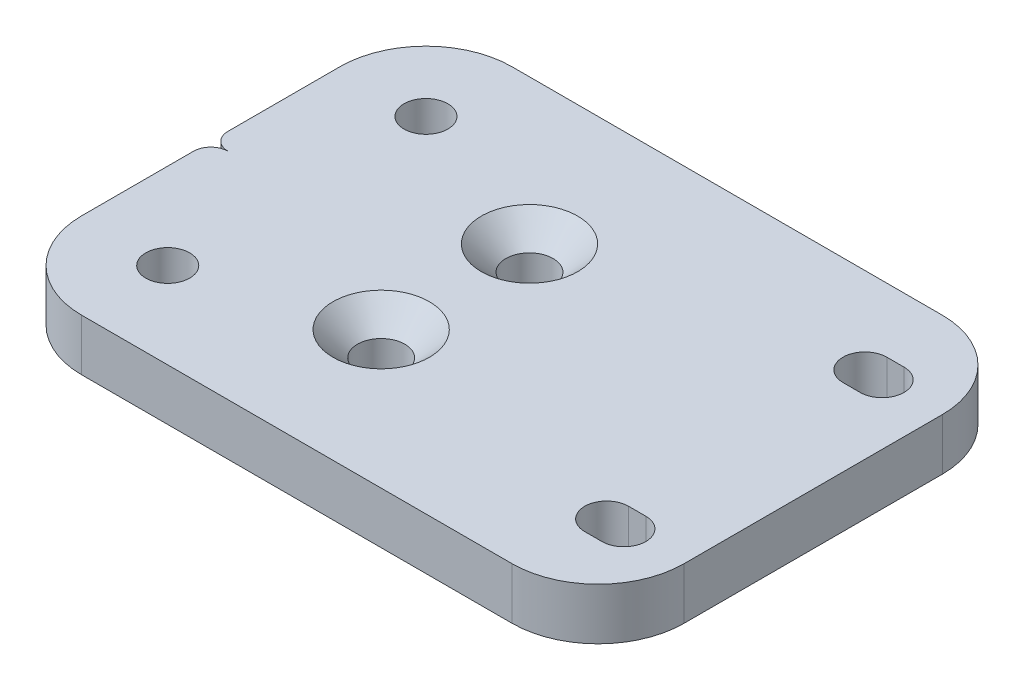
ISO-10303-21;
HEADER;
FILE_DESCRIPTION(('STEP AP214'),'2;1');
FILE_NAME('part.step','',(''),(''),'','','');
FILE_SCHEMA(('AUTOMOTIVE_DESIGN { 1 0 10303 214 1 1 1 1 }'));
ENDSEC;
DATA;
#1=APPLICATION_CONTEXT('core data for automotive mechanical design processes');
#2=APPLICATION_PROTOCOL_DEFINITION('international standard','automotive_design',2000,#1);
#3=PRODUCT_CONTEXT('',#1,'mechanical');
#4=PRODUCT('Part','Part','',(#3));
#5=PRODUCT_RELATED_PRODUCT_CATEGORY('part','',(#4));
#6=PRODUCT_DEFINITION_FORMATION('','',#4);
#7=PRODUCT_DEFINITION_CONTEXT('part definition',#1,'design');
#8=PRODUCT_DEFINITION('design','',#6,#7);
#9=PRODUCT_DEFINITION_SHAPE('','',#8);
#10=(LENGTH_UNIT() NAMED_UNIT(*) SI_UNIT(.MILLI.,.METRE.));
#11=(NAMED_UNIT(*) PLANE_ANGLE_UNIT() SI_UNIT($,.RADIAN.));
#12=(NAMED_UNIT(*) SI_UNIT($,.STERADIAN.) SOLID_ANGLE_UNIT());
#13=UNCERTAINTY_MEASURE_WITH_UNIT(LENGTH_MEASURE(1.E-05),#10,'distance_accuracy_value','');
#14=(GEOMETRIC_REPRESENTATION_CONTEXT(3) GLOBAL_UNCERTAINTY_ASSIGNED_CONTEXT((#13)) GLOBAL_UNIT_ASSIGNED_CONTEXT((#10,
#11,#12)) REPRESENTATION_CONTEXT('',''));
#15=CARTESIAN_POINT('',(0.,0.,0.));
#16=DIRECTION('',(0.,0.,1.));
#17=DIRECTION('',(1.,0.,0.));
#18=AXIS2_PLACEMENT_3D('',#15,#16,#17);
#19=CARTESIAN_POINT('',(-35.,6.,15.));
#20=DIRECTION('',(1.,0.,0.));
#21=DIRECTION('',(0.,0.,-1.));
#22=AXIS2_PLACEMENT_3D('',#19,#20,#21);
#23=PLANE('',#22);
#24=DIRECTION('',(0.,-1.,0.));
#25=VECTOR('',#24,1.);
#26=CARTESIAN_POINT('',(-35.,6.,2.));
#27=LINE('',#26,#25);
#28=CARTESIAN_POINT('',(-35.,6.,2.));
#29=VERTEX_POINT('',#28);
#30=CARTESIAN_POINT('',(-35.,0.,2.));
#31=VERTEX_POINT('',#30);
#32=EDGE_CURVE('E166',#29,#31,#27,.T.);
#33=ORIENTED_EDGE('',*,*,#32,.T.);
#34=DIRECTION('',(0.,0.,1.));
#35=VECTOR('',#34,1.);
#36=CARTESIAN_POINT('',(-35.,0.,15.));
#37=LINE('',#36,#35);
#38=CARTESIAN_POINT('',(-35.,0.,15.));
#39=VERTEX_POINT('',#38);
#40=EDGE_CURVE('E212',#31,#39,#37,.T.);
#41=ORIENTED_EDGE('',*,*,#40,.T.);
#42=DIRECTION('',(0.,-1.,0.));
#43=VECTOR('',#42,1.);
#44=CARTESIAN_POINT('',(-35.,6.,15.));
#45=LINE('',#44,#43);
#46=CARTESIAN_POINT('',(-35.,6.,15.));
#47=VERTEX_POINT('',#46);
#48=EDGE_CURVE('E186',#47,#39,#45,.T.);
#49=ORIENTED_EDGE('',*,*,#48,.F.);
#50=DIRECTION('',(0.,0.,1.));
#51=VECTOR('',#50,1.);
#52=CARTESIAN_POINT('',(-35.,6.,15.));
#53=LINE('',#52,#51);
#54=EDGE_CURVE('E180',#29,#47,#53,.T.);
#55=ORIENTED_EDGE('',*,*,#54,.F.);
#56=EDGE_LOOP('',(#33,#41,#49,#55));
#57=FACE_BOUND('',#56,.T.);
#58=ADVANCED_FACE('F34',(#57),#23,.F.);
#59=CARTESIAN_POINT('',(25.,6.,-15.));
#60=DIRECTION('',(0.,-1.,0.));
#61=DIRECTION('',(0.,0.,-1.));
#62=AXIS2_PLACEMENT_3D('',#59,#60,#61);
#63=CYLINDRICAL_SURFACE('',#62,10.);
#64=CARTESIAN_POINT('',(25.,0.,-15.));
#65=DIRECTION('',(0.,1.,0.));
#66=DIRECTION('',(0.,0.,-1.));
#67=AXIS2_PLACEMENT_3D('',#64,#65,#66);
#68=CIRCLE('',#67,10.);
#69=CARTESIAN_POINT('',(35.,0.,-15.));
#70=VERTEX_POINT('',#69);
#71=CARTESIAN_POINT('',(25.,0.,-25.));
#72=VERTEX_POINT('',#71);
#73=EDGE_CURVE('E204',#70,#72,#68,.T.);
#74=ORIENTED_EDGE('',*,*,#73,.T.);
#75=DIRECTION('',(0.,-1.,0.));
#76=VECTOR('',#75,1.);
#77=CARTESIAN_POINT('',(25.,6.,-25.));
#78=LINE('',#77,#76);
#79=CARTESIAN_POINT('',(25.,6.,-25.));
#80=VERTEX_POINT('',#79);
#81=EDGE_CURVE('E11',#80,#72,#78,.T.);
#82=ORIENTED_EDGE('',*,*,#81,.F.);
#83=CARTESIAN_POINT('',(25.,6.,-15.));
#84=DIRECTION('',(0.,1.,0.));
#85=DIRECTION('',(0.,0.,-1.));
#86=AXIS2_PLACEMENT_3D('',#83,#84,#85);
#87=CIRCLE('',#86,10.);
#88=CARTESIAN_POINT('',(35.,6.,-15.));
#89=VERTEX_POINT('',#88);
#90=EDGE_CURVE('E224',#89,#80,#87,.T.);
#91=ORIENTED_EDGE('',*,*,#90,.F.);
#92=DIRECTION('',(0.,-1.,0.));
#93=VECTOR('',#92,1.);
#94=CARTESIAN_POINT('',(35.,6.,-15.));
#95=LINE('',#94,#93);
#96=EDGE_CURVE('E203',#89,#70,#95,.T.);
#97=ORIENTED_EDGE('',*,*,#96,.T.);
#98=EDGE_LOOP('',(#74,#82,#91,#97));
#99=FACE_BOUND('',#98,.T.);
#100=ADVANCED_FACE('F36',(#99),#63,.T.);
#101=CARTESIAN_POINT('',(-25.,6.,-25.));
#102=DIRECTION('',(0.,0.,1.));
#103=DIRECTION('',(1.,0.,0.));
#104=AXIS2_PLACEMENT_3D('',#101,#102,#103);
#105=PLANE('',#104);
#106=DIRECTION('',(-1.,0.,0.));
#107=VECTOR('',#106,1.);
#108=CARTESIAN_POINT('',(-25.,0.,-25.));
#109=LINE('',#108,#107);
#110=CARTESIAN_POINT('',(-25.,0.,-25.));
#111=VERTEX_POINT('',#110);
#112=EDGE_CURVE('E207',#72,#111,#109,.T.);
#113=ORIENTED_EDGE('',*,*,#112,.T.);
#114=DIRECTION('',(0.,-1.,0.));
#115=VECTOR('',#114,1.);
#116=CARTESIAN_POINT('',(-25.,6.,-25.));
#117=LINE('',#116,#115);
#118=CARTESIAN_POINT('',(-25.,6.,-25.));
#119=VERTEX_POINT('',#118);
#120=EDGE_CURVE('E42',#119,#111,#117,.T.);
#121=ORIENTED_EDGE('',*,*,#120,.F.);
#122=DIRECTION('',(-1.,0.,0.));
#123=VECTOR('',#122,1.);
#124=CARTESIAN_POINT('',(-25.,6.,-25.));
#125=LINE('',#124,#123);
#126=EDGE_CURVE('E192',#80,#119,#125,.T.);
#127=ORIENTED_EDGE('',*,*,#126,.F.);
#128=ORIENTED_EDGE('',*,*,#81,.T.);
#129=EDGE_LOOP('',(#113,#121,#127,#128));
#130=FACE_BOUND('',#129,.T.);
#131=ADVANCED_FACE('F394',(#130),#105,.F.);
#132=CARTESIAN_POINT('',(-25.,6.,-15.));
#133=DIRECTION('',(0.,-1.,0.));
#134=DIRECTION('',(0.,0.,-1.));
#135=AXIS2_PLACEMENT_3D('',#132,#133,#134);
#136=CYLINDRICAL_SURFACE('',#135,10.);
#137=CARTESIAN_POINT('',(-25.,0.,-15.));
#138=DIRECTION('',(0.,1.,0.));
#139=DIRECTION('',(0.,0.,-1.));
#140=AXIS2_PLACEMENT_3D('',#137,#138,#139);
#141=CIRCLE('',#140,10.);
#142=CARTESIAN_POINT('',(-35.,0.,-15.));
#143=VERTEX_POINT('',#142);
#144=EDGE_CURVE('E210',#111,#143,#141,.T.);
#145=ORIENTED_EDGE('',*,*,#144,.T.);
#146=DIRECTION('',(0.,-1.,0.));
#147=VECTOR('',#146,1.);
#148=CARTESIAN_POINT('',(-35.,6.,-15.));
#149=LINE('',#148,#147);
#150=CARTESIAN_POINT('',(-35.,6.,-15.));
#151=VERTEX_POINT('',#150);
#152=EDGE_CURVE('E237',#151,#143,#149,.T.);
#153=ORIENTED_EDGE('',*,*,#152,.F.);
#154=CARTESIAN_POINT('',(-25.,6.,-15.));
#155=DIRECTION('',(0.,1.,0.));
#156=DIRECTION('',(0.,0.,-1.));
#157=AXIS2_PLACEMENT_3D('',#154,#155,#156);
#158=CIRCLE('',#157,10.);
#159=EDGE_CURVE('E189',#119,#151,#158,.T.);
#160=ORIENTED_EDGE('',*,*,#159,.F.);
#161=ORIENTED_EDGE('',*,*,#120,.T.);
#162=EDGE_LOOP('',(#145,#153,#160,#161));
#163=FACE_BOUND('',#162,.T.);
#164=ADVANCED_FACE('F244',(#163),#136,.T.);
#165=CARTESIAN_POINT('',(-35.,0.,-1.99999999999999));
#166=VERTEX_POINT('',#165);
#167=EDGE_CURVE('E213',#143,#166,#37,.T.);
#168=ORIENTED_EDGE('',*,*,#167,.T.);
#169=DIRECTION('',(0.,-1.,0.));
#170=VECTOR('',#169,1.);
#171=CARTESIAN_POINT('',(-35.,6.,-2.));
#172=LINE('',#171,#170);
#173=CARTESIAN_POINT('',(-35.,6.,-2.));
#174=VERTEX_POINT('',#173);
#175=EDGE_CURVE('E49',#174,#166,#172,.T.);
#176=ORIENTED_EDGE('',*,*,#175,.F.);
#177=EDGE_CURVE('E188',#151,#174,#53,.T.);
#178=ORIENTED_EDGE('',*,*,#177,.F.);
#179=ORIENTED_EDGE('',*,*,#152,.T.);
#180=EDGE_LOOP('',(#168,#176,#178,#179));
#181=FACE_BOUND('',#180,.T.);
#182=ADVANCED_FACE('F253',(#181),#23,.F.);
#183=CARTESIAN_POINT('',(-25.,6.,15.));
#184=DIRECTION('',(0.,-1.,0.));
#185=DIRECTION('',(0.,0.,-1.));
#186=AXIS2_PLACEMENT_3D('',#183,#184,#185);
#187=CYLINDRICAL_SURFACE('',#186,10.);
#188=CARTESIAN_POINT('',(-25.,0.,15.));
#189=DIRECTION('',(0.,1.,0.));
#190=DIRECTION('',(0.,0.,-1.));
#191=AXIS2_PLACEMENT_3D('',#188,#189,#190);
#192=CIRCLE('',#191,10.);
#193=CARTESIAN_POINT('',(-25.,0.,25.));
#194=VERTEX_POINT('',#193);
#195=EDGE_CURVE('E216',#39,#194,#192,.T.);
#196=ORIENTED_EDGE('',*,*,#195,.T.);
#197=DIRECTION('',(0.,-1.,0.));
#198=VECTOR('',#197,1.);
#199=CARTESIAN_POINT('',(-25.,6.,25.));
#200=LINE('',#199,#198);
#201=CARTESIAN_POINT('',(-25.,6.,25.));
#202=VERTEX_POINT('',#201);
#203=EDGE_CURVE('E233',#202,#194,#200,.T.);
#204=ORIENTED_EDGE('',*,*,#203,.F.);
#205=CARTESIAN_POINT('',(-25.,6.,15.));
#206=DIRECTION('',(0.,1.,0.));
#207=DIRECTION('',(0.,0.,-1.));
#208=AXIS2_PLACEMENT_3D('',#205,#206,#207);
#209=CIRCLE('',#208,10.);
#210=EDGE_CURVE('E191',#47,#202,#209,.T.);
#211=ORIENTED_EDGE('',*,*,#210,.F.);
#212=ORIENTED_EDGE('',*,*,#48,.T.);
#213=EDGE_LOOP('',(#196,#204,#211,#212));
#214=FACE_BOUND('',#213,.T.);
#215=ADVANCED_FACE('F399',(#214),#187,.T.);
#216=CARTESIAN_POINT('',(-25.,6.,25.));
#217=DIRECTION('',(0.,0.,-1.));
#218=DIRECTION('',(-1.,0.,0.));
#219=AXIS2_PLACEMENT_3D('',#216,#217,#218);
#220=PLANE('',#219);
#221=DIRECTION('',(1.,0.,0.));
#222=VECTOR('',#221,1.);
#223=CARTESIAN_POINT('',(-25.,0.,25.));
#224=LINE('',#223,#222);
#225=CARTESIAN_POINT('',(25.,0.,25.));
#226=VERTEX_POINT('',#225);
#227=EDGE_CURVE('E218',#194,#226,#224,.T.);
#228=ORIENTED_EDGE('',*,*,#227,.T.);
#229=DIRECTION('',(0.,-1.,0.));
#230=VECTOR('',#229,1.);
#231=CARTESIAN_POINT('',(25.,6.,25.));
#232=LINE('',#231,#230);
#233=CARTESIAN_POINT('',(25.,6.,25.));
#234=VERTEX_POINT('',#233);
#235=EDGE_CURVE('E230',#234,#226,#232,.T.);
#236=ORIENTED_EDGE('',*,*,#235,.F.);
#237=DIRECTION('',(1.,0.,0.));
#238=VECTOR('',#237,1.);
#239=CARTESIAN_POINT('',(-25.,6.,25.));
#240=LINE('',#239,#238);
#241=EDGE_CURVE('E197',#202,#234,#240,.T.);
#242=ORIENTED_EDGE('',*,*,#241,.F.);
#243=ORIENTED_EDGE('',*,*,#203,.T.);
#244=EDGE_LOOP('',(#228,#236,#242,#243));
#245=FACE_BOUND('',#244,.T.);
#246=ADVANCED_FACE('F404',(#245),#220,.F.);
#247=CARTESIAN_POINT('',(25.,6.,15.));
#248=DIRECTION('',(0.,-1.,0.));
#249=DIRECTION('',(0.,0.,-1.));
#250=AXIS2_PLACEMENT_3D('',#247,#248,#249);
#251=CYLINDRICAL_SURFACE('',#250,10.);
#252=CARTESIAN_POINT('',(25.,0.,15.));
#253=DIRECTION('',(0.,1.,0.));
#254=DIRECTION('',(0.,0.,1.));
#255=AXIS2_PLACEMENT_3D('',#252,#253,#254);
#256=CIRCLE('',#255,10.);
#257=CARTESIAN_POINT('',(35.,0.,15.));
#258=VERTEX_POINT('',#257);
#259=EDGE_CURVE('E220',#226,#258,#256,.T.);
#260=ORIENTED_EDGE('',*,*,#259,.T.);
#261=DIRECTION('',(0.,-1.,0.));
#262=VECTOR('',#261,1.);
#263=CARTESIAN_POINT('',(35.,6.,15.));
#264=LINE('',#263,#262);
#265=CARTESIAN_POINT('',(35.,6.,15.));
#266=VERTEX_POINT('',#265);
#267=EDGE_CURVE('E227',#266,#258,#264,.T.);
#268=ORIENTED_EDGE('',*,*,#267,.F.);
#269=CARTESIAN_POINT('',(25.,6.,15.));
#270=DIRECTION('',(0.,1.,0.));
#271=DIRECTION('',(0.,0.,1.));
#272=AXIS2_PLACEMENT_3D('',#269,#270,#271);
#273=CIRCLE('',#272,10.);
#274=EDGE_CURVE('E199',#234,#266,#273,.T.);
#275=ORIENTED_EDGE('',*,*,#274,.F.);
#276=ORIENTED_EDGE('',*,*,#235,.T.);
#277=EDGE_LOOP('',(#260,#268,#275,#276));
#278=FACE_BOUND('',#277,.T.);
#279=ADVANCED_FACE('F420',(#278),#251,.T.);
#280=CARTESIAN_POINT('',(35.,6.,15.));
#281=DIRECTION('',(-1.,0.,0.));
#282=DIRECTION('',(0.,0.,1.));
#283=AXIS2_PLACEMENT_3D('',#280,#281,#282);
#284=PLANE('',#283);
#285=DIRECTION('',(0.,0.,-1.));
#286=VECTOR('',#285,1.);
#287=CARTESIAN_POINT('',(35.,0.,15.));
#288=LINE('',#287,#286);
#289=EDGE_CURVE('E222',#258,#70,#288,.T.);
#290=ORIENTED_EDGE('',*,*,#289,.T.);
#291=ORIENTED_EDGE('',*,*,#96,.F.);
#292=DIRECTION('',(0.,0.,-1.));
#293=VECTOR('',#292,1.);
#294=CARTESIAN_POINT('',(35.,6.,15.));
#295=LINE('',#294,#293);
#296=EDGE_CURVE('E201',#266,#89,#295,.T.);
#297=ORIENTED_EDGE('',*,*,#296,.F.);
#298=ORIENTED_EDGE('',*,*,#267,.T.);
#299=EDGE_LOOP('',(#290,#291,#297,#298));
#300=FACE_BOUND('',#299,.T.);
#301=ADVANCED_FACE('F362',(#300),#284,.F.);
#302=CARTESIAN_POINT('',(25.,6.,-15.));
#303=DIRECTION('',(0.,-1.,0.));
#304=DIRECTION('',(0.,0.,-1.));
#305=AXIS2_PLACEMENT_3D('',#302,#303,#304);
#306=PLANE('',#305);
#307=CARTESIAN_POINT('',(-6.15938121122889,6.,9.0403392542844));
#308=DIRECTION('',(0.,1.,0.));
#309=DIRECTION('',(0.,0.,1.));
#310=AXIS2_PLACEMENT_3D('',#307,#308,#309);
#311=CIRCLE('',#310,5.6);
#312=CARTESIAN_POINT('',(-6.15938121122889,6.,14.6403392542844));
#313=VERTEX_POINT('',#312);
#314=EDGE_CURVE('E354',#313,#313,#311,.T.);
#315=ORIENTED_EDGE('',*,*,#314,.F.);
#316=EDGE_LOOP('',(#315));
#317=FACE_BOUND('',#316,.T.);
#318=CARTESIAN_POINT('',(-6.15938121122889,6.,-8.19258518415884));
#319=DIRECTION('',(0.,1.,0.));
#320=DIRECTION('',(0.,0.,1.));
#321=AXIS2_PLACEMENT_3D('',#318,#319,#320);
#322=CIRCLE('',#321,5.6);
#323=CARTESIAN_POINT('',(-6.15938121122889,6.,-2.59258518415884));
#324=VERTEX_POINT('',#323);
#325=EDGE_CURVE('E345',#324,#324,#322,.T.);
#326=ORIENTED_EDGE('',*,*,#325,.F.);
#327=EDGE_LOOP('',(#326));
#328=FACE_BOUND('',#327,.T.);
#329=CARTESIAN_POINT('',(-25.,6.,15.));
#330=DIRECTION('',(0.,-1.,0.));
#331=DIRECTION('',(0.,0.,1.));
#332=AXIS2_PLACEMENT_3D('',#329,#330,#331);
#333=CIRCLE('',#332,2.55);
#334=CARTESIAN_POINT('',(-25.,6.,17.55));
#335=VERTEX_POINT('',#334);
#336=EDGE_CURVE('E269',#335,#335,#333,.T.);
#337=ORIENTED_EDGE('',*,*,#336,.T.);
#338=EDGE_LOOP('',(#337));
#339=FACE_BOUND('',#338,.T.);
#340=DIRECTION('',(1.,0.,0.));
#341=VECTOR('',#340,1.);
#342=CARTESIAN_POINT('',(28.,6.,12.45));
#343=LINE('',#342,#341);
#344=CARTESIAN_POINT('',(26.,6.,12.45));
#345=VERTEX_POINT('',#344);
#346=CARTESIAN_POINT('',(28.,6.,12.45));
#347=VERTEX_POINT('',#346);
#348=EDGE_CURVE('E278',#345,#347,#343,.T.);
#349=ORIENTED_EDGE('',*,*,#348,.T.);
#350=CARTESIAN_POINT('',(28.,6.,15.));
#351=DIRECTION('',(0.,-1.,0.));
#352=DIRECTION('',(0.,0.,1.));
#353=AXIS2_PLACEMENT_3D('',#350,#351,#352);
#354=CIRCLE('',#353,2.55000000000002);
#355=CARTESIAN_POINT('',(28.,6.,17.55));
#356=VERTEX_POINT('',#355);
#357=EDGE_CURVE('E288',#347,#356,#354,.T.);
#358=ORIENTED_EDGE('',*,*,#357,.T.);
#359=DIRECTION('',(-1.,0.,0.));
#360=VECTOR('',#359,1.);
#361=CARTESIAN_POINT('',(28.,6.,17.55));
#362=LINE('',#361,#360);
#363=CARTESIAN_POINT('',(26.,6.,17.55));
#364=VERTEX_POINT('',#363);
#365=EDGE_CURVE('E299',#356,#364,#362,.T.);
#366=ORIENTED_EDGE('',*,*,#365,.T.);
#367=CARTESIAN_POINT('',(26.,6.,15.));
#368=DIRECTION('',(0.,-1.,0.));
#369=DIRECTION('',(0.,0.,1.));
#370=AXIS2_PLACEMENT_3D('',#367,#368,#369);
#371=CIRCLE('',#370,2.55000000000002);
#372=EDGE_CURVE('E57',#364,#345,#371,.T.);
#373=ORIENTED_EDGE('',*,*,#372,.T.);
#374=EDGE_LOOP('',(#349,#358,#366,#373));
#375=FACE_BOUND('',#374,.T.);
#376=DIRECTION('',(1.,0.,0.));
#377=VECTOR('',#376,1.);
#378=CARTESIAN_POINT('',(28.,6.,-17.55));
#379=LINE('',#378,#377);
#380=CARTESIAN_POINT('',(26.,6.,-17.55));
#381=VERTEX_POINT('',#380);
#382=CARTESIAN_POINT('',(28.,6.,-17.55));
#383=VERTEX_POINT('',#382);
#384=EDGE_CURVE('E308',#381,#383,#379,.T.);
#385=ORIENTED_EDGE('',*,*,#384,.T.);
#386=CARTESIAN_POINT('',(28.,6.,-15.));
#387=DIRECTION('',(0.,-1.,0.));
#388=DIRECTION('',(0.,0.,-1.));
#389=AXIS2_PLACEMENT_3D('',#386,#387,#388);
#390=CIRCLE('',#389,2.55000000000002);
#391=CARTESIAN_POINT('',(28.,6.,-12.45));
#392=VERTEX_POINT('',#391);
#393=EDGE_CURVE('E316',#383,#392,#390,.T.);
#394=ORIENTED_EDGE('',*,*,#393,.T.);
#395=DIRECTION('',(-1.,0.,0.));
#396=VECTOR('',#395,1.);
#397=CARTESIAN_POINT('',(28.,6.,-12.45));
#398=LINE('',#397,#396);
#399=CARTESIAN_POINT('',(26.,6.,-12.45));
#400=VERTEX_POINT('',#399);
#401=EDGE_CURVE('E329',#392,#400,#398,.T.);
#402=ORIENTED_EDGE('',*,*,#401,.T.);
#403=CARTESIAN_POINT('',(26.,6.,-15.));
#404=DIRECTION('',(0.,-1.,0.));
#405=DIRECTION('',(0.,0.,-1.));
#406=AXIS2_PLACEMENT_3D('',#403,#404,#405);
#407=CIRCLE('',#406,2.55000000000002);
#408=EDGE_CURVE('E326',#400,#381,#407,.T.);
#409=ORIENTED_EDGE('',*,*,#408,.T.);
#410=EDGE_LOOP('',(#385,#394,#402,#409));
#411=FACE_BOUND('',#410,.T.);
#412=CARTESIAN_POINT('',(-25.,6.,-15.));
#413=DIRECTION('',(0.,-1.,0.));
#414=DIRECTION('',(0.,0.,-1.));
#415=AXIS2_PLACEMENT_3D('',#412,#413,#414);
#416=CIRCLE('',#415,2.55);
#417=CARTESIAN_POINT('',(-25.,6.,-17.55));
#418=VERTEX_POINT('',#417);
#419=EDGE_CURVE('E208',#418,#418,#416,.T.);
#420=ORIENTED_EDGE('',*,*,#419,.T.);
#421=EDGE_LOOP('',(#420));
#422=FACE_BOUND('',#421,.T.);
#423=CARTESIAN_POINT('',(-33.,6.,-2.));
#424=DIRECTION('',(0.,1.,0.));
#425=DIRECTION('',(0.,0.,-1.));
#426=AXIS2_PLACEMENT_3D('',#423,#424,#425);
#427=CIRCLE('',#426,2.);
#428=CARTESIAN_POINT('',(-33.,6.,0.));
#429=VERTEX_POINT('',#428);
#430=EDGE_CURVE('E176',#174,#429,#427,.T.);
#431=ORIENTED_EDGE('',*,*,#430,.T.);
#432=CARTESIAN_POINT('',(-33.,6.,2.));
#433=DIRECTION('',(0.,1.,0.));
#434=DIRECTION('',(0.,0.,1.));
#435=AXIS2_PLACEMENT_3D('',#432,#433,#434);
#436=CIRCLE('',#435,2.);
#437=EDGE_CURVE('E169',#429,#29,#436,.T.);
#438=ORIENTED_EDGE('',*,*,#437,.T.);
#439=ORIENTED_EDGE('',*,*,#54,.T.);
#440=ORIENTED_EDGE('',*,*,#210,.T.);
#441=ORIENTED_EDGE('',*,*,#241,.T.);
#442=ORIENTED_EDGE('',*,*,#274,.T.);
#443=ORIENTED_EDGE('',*,*,#296,.T.);
#444=ORIENTED_EDGE('',*,*,#90,.T.);
#445=ORIENTED_EDGE('',*,*,#126,.T.);
#446=ORIENTED_EDGE('',*,*,#159,.T.);
#447=ORIENTED_EDGE('',*,*,#177,.T.);
#448=EDGE_LOOP('',(#431,#438,#439,#440,#441,#442,#443,#444,#445,#446,#447));
#449=FACE_BOUND('',#448,.T.);
#450=ADVANCED_FACE('F179',(#317,#328,#339,#375,#411,#422,#449),#306,.F.);
#451=CARTESIAN_POINT('',(25.,0.,-15.));
#452=DIRECTION('',(0.,-1.,0.));
#453=DIRECTION('',(0.,0.,-1.));
#454=AXIS2_PLACEMENT_3D('',#451,#452,#453);
#455=PLANE('',#454);
#456=CARTESIAN_POINT('',(-6.15938121122889,0.,9.0403392542844));
#457=DIRECTION('',(0.,1.,0.));
#458=DIRECTION('',(0.,0.,1.));
#459=AXIS2_PLACEMENT_3D('',#456,#457,#458);
#460=CIRCLE('',#459,2.74999999999999);
#461=CARTESIAN_POINT('',(-6.15938121122889,0.,11.7903392542844));
#462=VERTEX_POINT('',#461);
#463=EDGE_CURVE('E348',#462,#462,#460,.T.);
#464=ORIENTED_EDGE('',*,*,#463,.T.);
#465=EDGE_LOOP('',(#464));
#466=FACE_BOUND('',#465,.T.);
#467=CARTESIAN_POINT('',(-6.15938121122889,0.,-8.19258518415884));
#468=DIRECTION('',(0.,1.,0.));
#469=DIRECTION('',(0.,0.,1.));
#470=AXIS2_PLACEMENT_3D('',#467,#468,#469);
#471=CIRCLE('',#470,2.74999999999999);
#472=CARTESIAN_POINT('',(-6.15938121122889,0.,-5.44258518415885));
#473=VERTEX_POINT('',#472);
#474=EDGE_CURVE('E338',#473,#473,#471,.T.);
#475=ORIENTED_EDGE('',*,*,#474,.T.);
#476=EDGE_LOOP('',(#475));
#477=FACE_BOUND('',#476,.T.);
#478=CARTESIAN_POINT('',(-33.,0.,2.));
#479=DIRECTION('',(0.,1.,0.));
#480=DIRECTION('',(0.,0.,1.));
#481=AXIS2_PLACEMENT_3D('',#478,#479,#480);
#482=CIRCLE('',#481,2.);
#483=CARTESIAN_POINT('',(-33.,0.,0.));
#484=VERTEX_POINT('',#483);
#485=EDGE_CURVE('E172',#484,#31,#482,.T.);
#486=ORIENTED_EDGE('',*,*,#485,.F.);
#487=CARTESIAN_POINT('',(-33.,0.,-2.));
#488=DIRECTION('',(0.,1.,0.));
#489=DIRECTION('',(0.,0.,-1.));
#490=AXIS2_PLACEMENT_3D('',#487,#488,#489);
#491=CIRCLE('',#490,2.);
#492=EDGE_CURVE('E183',#166,#484,#491,.T.);
#493=ORIENTED_EDGE('',*,*,#492,.F.);
#494=ORIENTED_EDGE('',*,*,#167,.F.);
#495=ORIENTED_EDGE('',*,*,#144,.F.);
#496=ORIENTED_EDGE('',*,*,#112,.F.);
#497=ORIENTED_EDGE('',*,*,#73,.F.);
#498=ORIENTED_EDGE('',*,*,#289,.F.);
#499=ORIENTED_EDGE('',*,*,#259,.F.);
#500=ORIENTED_EDGE('',*,*,#227,.F.);
#501=ORIENTED_EDGE('',*,*,#195,.F.);
#502=ORIENTED_EDGE('',*,*,#40,.F.);
#503=EDGE_LOOP('',(#486,#493,#494,#495,#496,#497,#498,#499,#500,#501,#502));
#504=FACE_BOUND('',#503,.T.);
#505=CARTESIAN_POINT('',(-25.,0.,15.));
#506=DIRECTION('',(0.,-1.,0.));
#507=DIRECTION('',(0.,0.,1.));
#508=AXIS2_PLACEMENT_3D('',#505,#506,#507);
#509=CIRCLE('',#508,2.55);
#510=CARTESIAN_POINT('',(-25.,0.,17.55));
#511=VERTEX_POINT('',#510);
#512=EDGE_CURVE('E266',#511,#511,#509,.T.);
#513=ORIENTED_EDGE('',*,*,#512,.F.);
#514=EDGE_LOOP('',(#513));
#515=FACE_BOUND('',#514,.T.);
#516=CARTESIAN_POINT('',(28.,0.,15.));
#517=DIRECTION('',(0.,-1.,0.));
#518=DIRECTION('',(0.,0.,1.));
#519=AXIS2_PLACEMENT_3D('',#516,#517,#518);
#520=CIRCLE('',#519,2.55000000000002);
#521=CARTESIAN_POINT('',(28.,0.,12.45));
#522=VERTEX_POINT('',#521);
#523=CARTESIAN_POINT('',(28.,0.,17.55));
#524=VERTEX_POINT('',#523);
#525=EDGE_CURVE('E273',#522,#524,#520,.T.);
#526=ORIENTED_EDGE('',*,*,#525,.F.);
#527=DIRECTION('',(1.,0.,0.));
#528=VECTOR('',#527,1.);
#529=CARTESIAN_POINT('',(28.,0.,12.45));
#530=LINE('',#529,#528);
#531=CARTESIAN_POINT('',(26.,0.,12.45));
#532=VERTEX_POINT('',#531);
#533=EDGE_CURVE('E285',#532,#522,#530,.T.);
#534=ORIENTED_EDGE('',*,*,#533,.F.);
#535=CARTESIAN_POINT('',(26.,0.,15.));
#536=DIRECTION('',(0.,-1.,0.));
#537=DIRECTION('',(0.,0.,1.));
#538=AXIS2_PLACEMENT_3D('',#535,#536,#537);
#539=CIRCLE('',#538,2.55000000000002);
#540=CARTESIAN_POINT('',(26.,0.,17.55));
#541=VERTEX_POINT('',#540);
#542=EDGE_CURVE('E289',#541,#532,#539,.T.);
#543=ORIENTED_EDGE('',*,*,#542,.F.);
#544=DIRECTION('',(-1.,0.,0.));
#545=VECTOR('',#544,1.);
#546=CARTESIAN_POINT('',(28.,0.,17.55));
#547=LINE('',#546,#545);
#548=EDGE_CURVE('E292',#524,#541,#547,.T.);
#549=ORIENTED_EDGE('',*,*,#548,.F.);
#550=EDGE_LOOP('',(#526,#534,#543,#549));
#551=FACE_BOUND('',#550,.T.);
#552=CARTESIAN_POINT('',(28.,0.,-15.));
#553=DIRECTION('',(0.,-1.,0.));
#554=DIRECTION('',(0.,0.,-1.));
#555=AXIS2_PLACEMENT_3D('',#552,#553,#554);
#556=CIRCLE('',#555,2.55000000000002);
#557=CARTESIAN_POINT('',(28.,0.,-17.55));
#558=VERTEX_POINT('',#557);
#559=CARTESIAN_POINT('',(28.,0.,-12.45));
#560=VERTEX_POINT('',#559);
#561=EDGE_CURVE('E284',#558,#560,#556,.T.);
#562=ORIENTED_EDGE('',*,*,#561,.F.);
#563=DIRECTION('',(1.,0.,0.));
#564=VECTOR('',#563,1.);
#565=CARTESIAN_POINT('',(28.,0.,-17.55));
#566=LINE('',#565,#564);
#567=CARTESIAN_POINT('',(26.,0.,-17.55));
#568=VERTEX_POINT('',#567);
#569=EDGE_CURVE('E313',#568,#558,#566,.T.);
#570=ORIENTED_EDGE('',*,*,#569,.F.);
#571=CARTESIAN_POINT('',(26.,0.,-15.));
#572=DIRECTION('',(0.,-1.,0.));
#573=DIRECTION('',(0.,0.,-1.));
#574=AXIS2_PLACEMENT_3D('',#571,#572,#573);
#575=CIRCLE('',#574,2.55000000000002);
#576=CARTESIAN_POINT('',(26.,0.,-12.45));
#577=VERTEX_POINT('',#576);
#578=EDGE_CURVE('E317',#577,#568,#575,.T.);
#579=ORIENTED_EDGE('',*,*,#578,.F.);
#580=DIRECTION('',(-1.,0.,0.));
#581=VECTOR('',#580,1.);
#582=CARTESIAN_POINT('',(28.,0.,-12.45));
#583=LINE('',#582,#581);
#584=EDGE_CURVE('E320',#560,#577,#583,.T.);
#585=ORIENTED_EDGE('',*,*,#584,.F.);
#586=EDGE_LOOP('',(#562,#570,#579,#585));
#587=FACE_BOUND('',#586,.T.);
#588=CARTESIAN_POINT('',(-25.,0.,-15.));
#589=DIRECTION('',(0.,-1.,0.));
#590=DIRECTION('',(0.,0.,-1.));
#591=AXIS2_PLACEMENT_3D('',#588,#589,#590);
#592=CIRCLE('',#591,2.55);
#593=CARTESIAN_POINT('',(-25.,0.,-17.55));
#594=VERTEX_POINT('',#593);
#595=EDGE_CURVE('E260',#594,#594,#592,.T.);
#596=ORIENTED_EDGE('',*,*,#595,.F.);
#597=EDGE_LOOP('',(#596));
#598=FACE_BOUND('',#597,.T.);
#599=ADVANCED_FACE('F249',(#466,#477,#504,#515,#551,#587,#598),#455,.T.);
#600=CARTESIAN_POINT('',(-25.,6.,-15.));
#601=DIRECTION('',(0.,-1.,0.));
#602=DIRECTION('',(0.,0.,-1.));
#603=AXIS2_PLACEMENT_3D('',#600,#601,#602);
#604=CYLINDRICAL_SURFACE('',#603,2.55);
#605=ORIENTED_EDGE('',*,*,#419,.F.);
#606=EDGE_LOOP('',(#605));
#607=FACE_BOUND('',#606,.T.);
#608=ORIENTED_EDGE('',*,*,#595,.T.);
#609=EDGE_LOOP('',(#608));
#610=FACE_BOUND('',#609,.T.);
#611=ADVANCED_FACE('F374',(#607,#610),#604,.F.);
#612=CARTESIAN_POINT('',(28.,6.,-15.));
#613=DIRECTION('',(0.,-1.,0.));
#614=DIRECTION('',(0.,0.,-1.));
#615=AXIS2_PLACEMENT_3D('',#612,#613,#614);
#616=CYLINDRICAL_SURFACE('',#615,2.55000000000002);
#617=ORIENTED_EDGE('',*,*,#561,.T.);
#618=DIRECTION('',(0.,-1.,0.));
#619=VECTOR('',#618,1.);
#620=CARTESIAN_POINT('',(28.,6.,-12.45));
#621=LINE('',#620,#619);
#622=EDGE_CURVE('E304',#392,#560,#621,.T.);
#623=ORIENTED_EDGE('',*,*,#622,.F.);
#624=ORIENTED_EDGE('',*,*,#393,.F.);
#625=DIRECTION('',(0.,-1.,0.));
#626=VECTOR('',#625,1.);
#627=CARTESIAN_POINT('',(28.,6.,-17.55));
#628=LINE('',#627,#626);
#629=EDGE_CURVE('E263',#383,#558,#628,.T.);
#630=ORIENTED_EDGE('',*,*,#629,.T.);
#631=EDGE_LOOP('',(#617,#623,#624,#630));
#632=FACE_BOUND('',#631,.T.);
#633=ADVANCED_FACE('F377',(#632),#616,.F.);
#634=CARTESIAN_POINT('',(28.,6.,-17.55));
#635=DIRECTION('',(0.,0.,-1.));
#636=DIRECTION('',(-1.,0.,0.));
#637=AXIS2_PLACEMENT_3D('',#634,#635,#636);
#638=PLANE('',#637);
#639=ORIENTED_EDGE('',*,*,#569,.T.);
#640=ORIENTED_EDGE('',*,*,#629,.F.);
#641=ORIENTED_EDGE('',*,*,#384,.F.);
#642=DIRECTION('',(0.,-1.,0.));
#643=VECTOR('',#642,1.);
#644=CARTESIAN_POINT('',(26.,6.,-17.55));
#645=LINE('',#644,#643);
#646=EDGE_CURVE('E310',#381,#568,#645,.T.);
#647=ORIENTED_EDGE('',*,*,#646,.T.);
#648=EDGE_LOOP('',(#639,#640,#641,#647));
#649=FACE_BOUND('',#648,.T.);
#650=ADVANCED_FACE('F458',(#649),#638,.F.);
#651=CARTESIAN_POINT('',(26.,6.,-15.));
#652=DIRECTION('',(0.,-1.,0.));
#653=DIRECTION('',(0.,0.,-1.));
#654=AXIS2_PLACEMENT_3D('',#651,#652,#653);
#655=CYLINDRICAL_SURFACE('',#654,2.55000000000002);
#656=ORIENTED_EDGE('',*,*,#578,.T.);
#657=ORIENTED_EDGE('',*,*,#646,.F.);
#658=ORIENTED_EDGE('',*,*,#408,.F.);
#659=DIRECTION('',(0.,-1.,0.));
#660=VECTOR('',#659,1.);
#661=CARTESIAN_POINT('',(26.,6.,-12.45));
#662=LINE('',#661,#660);
#663=EDGE_CURVE('E307',#400,#577,#662,.T.);
#664=ORIENTED_EDGE('',*,*,#663,.T.);
#665=EDGE_LOOP('',(#656,#657,#658,#664));
#666=FACE_BOUND('',#665,.T.);
#667=ADVANCED_FACE('F466',(#666),#655,.F.);
#668=CARTESIAN_POINT('',(28.,6.,-12.45));
#669=DIRECTION('',(0.,0.,1.));
#670=DIRECTION('',(1.,0.,0.));
#671=AXIS2_PLACEMENT_3D('',#668,#669,#670);
#672=PLANE('',#671);
#673=ORIENTED_EDGE('',*,*,#584,.T.);
#674=ORIENTED_EDGE('',*,*,#663,.F.);
#675=ORIENTED_EDGE('',*,*,#401,.F.);
#676=ORIENTED_EDGE('',*,*,#622,.T.);
#677=EDGE_LOOP('',(#673,#674,#675,#676));
#678=FACE_BOUND('',#677,.T.);
#679=ADVANCED_FACE('F474',(#678),#672,.F.);
#680=CARTESIAN_POINT('',(28.,6.,15.));
#681=DIRECTION('',(0.,-1.,0.));
#682=DIRECTION('',(0.,0.,-1.));
#683=AXIS2_PLACEMENT_3D('',#680,#681,#682);
#684=CYLINDRICAL_SURFACE('',#683,2.55000000000002);
#685=ORIENTED_EDGE('',*,*,#525,.T.);
#686=DIRECTION('',(0.,-1.,0.));
#687=VECTOR('',#686,1.);
#688=CARTESIAN_POINT('',(28.,6.,17.55));
#689=LINE('',#688,#687);
#690=EDGE_CURVE('E274',#356,#524,#689,.T.);
#691=ORIENTED_EDGE('',*,*,#690,.F.);
#692=ORIENTED_EDGE('',*,*,#357,.F.);
#693=DIRECTION('',(0.,-1.,0.));
#694=VECTOR('',#693,1.);
#695=CARTESIAN_POINT('',(28.,6.,12.45));
#696=LINE('',#695,#694);
#697=EDGE_CURVE('E282',#347,#522,#696,.T.);
#698=ORIENTED_EDGE('',*,*,#697,.T.);
#699=EDGE_LOOP('',(#685,#691,#692,#698));
#700=FACE_BOUND('',#699,.T.);
#701=ADVANCED_FACE('F482',(#700),#684,.F.);
#702=CARTESIAN_POINT('',(28.,6.,12.45));
#703=DIRECTION('',(0.,0.,-1.));
#704=DIRECTION('',(-1.,0.,0.));
#705=AXIS2_PLACEMENT_3D('',#702,#703,#704);
#706=PLANE('',#705);
#707=ORIENTED_EDGE('',*,*,#533,.T.);
#708=ORIENTED_EDGE('',*,*,#697,.F.);
#709=ORIENTED_EDGE('',*,*,#348,.F.);
#710=DIRECTION('',(0.,-1.,0.));
#711=VECTOR('',#710,1.);
#712=CARTESIAN_POINT('',(26.,6.,12.45));
#713=LINE('',#712,#711);
#714=EDGE_CURVE('E280',#345,#532,#713,.T.);
#715=ORIENTED_EDGE('',*,*,#714,.T.);
#716=EDGE_LOOP('',(#707,#708,#709,#715));
#717=FACE_BOUND('',#716,.T.);
#718=ADVANCED_FACE('F490',(#717),#706,.F.);
#719=CARTESIAN_POINT('',(26.,6.,15.));
#720=DIRECTION('',(0.,-1.,0.));
#721=DIRECTION('',(0.,0.,-1.));
#722=AXIS2_PLACEMENT_3D('',#719,#720,#721);
#723=CYLINDRICAL_SURFACE('',#722,2.55000000000002);
#724=ORIENTED_EDGE('',*,*,#542,.T.);
#725=ORIENTED_EDGE('',*,*,#714,.F.);
#726=ORIENTED_EDGE('',*,*,#372,.F.);
#727=DIRECTION('',(0.,-1.,0.));
#728=VECTOR('',#727,1.);
#729=CARTESIAN_POINT('',(26.,6.,17.55));
#730=LINE('',#729,#728);
#731=EDGE_CURVE('E277',#364,#541,#730,.T.);
#732=ORIENTED_EDGE('',*,*,#731,.T.);
#733=EDGE_LOOP('',(#724,#725,#726,#732));
#734=FACE_BOUND('',#733,.T.);
#735=ADVANCED_FACE('F498',(#734),#723,.F.);
#736=CARTESIAN_POINT('',(28.,6.,17.55));
#737=DIRECTION('',(0.,0.,1.));
#738=DIRECTION('',(1.,0.,0.));
#739=AXIS2_PLACEMENT_3D('',#736,#737,#738);
#740=PLANE('',#739);
#741=ORIENTED_EDGE('',*,*,#548,.T.);
#742=ORIENTED_EDGE('',*,*,#731,.F.);
#743=ORIENTED_EDGE('',*,*,#365,.F.);
#744=ORIENTED_EDGE('',*,*,#690,.T.);
#745=EDGE_LOOP('',(#741,#742,#743,#744));
#746=FACE_BOUND('',#745,.T.);
#747=ADVANCED_FACE('F506',(#746),#740,.F.);
#748=CARTESIAN_POINT('',(-25.,6.,15.));
#749=DIRECTION('',(0.,-1.,0.));
#750=DIRECTION('',(0.,0.,-1.));
#751=AXIS2_PLACEMENT_3D('',#748,#749,#750);
#752=CYLINDRICAL_SURFACE('',#751,2.55);
#753=ORIENTED_EDGE('',*,*,#336,.F.);
#754=EDGE_LOOP('',(#753));
#755=FACE_BOUND('',#754,.T.);
#756=ORIENTED_EDGE('',*,*,#512,.T.);
#757=EDGE_LOOP('',(#756));
#758=FACE_BOUND('',#757,.T.);
#759=ADVANCED_FACE('F513',(#755,#758),#752,.F.);
#760=CARTESIAN_POINT('',(-33.,6.,2.));
#761=DIRECTION('',(0.,-1.,0.));
#762=DIRECTION('',(0.,0.,-1.));
#763=AXIS2_PLACEMENT_3D('',#760,#761,#762);
#764=CYLINDRICAL_SURFACE('',#763,2.);
#765=ORIENTED_EDGE('',*,*,#485,.T.);
#766=ORIENTED_EDGE('',*,*,#32,.F.);
#767=ORIENTED_EDGE('',*,*,#437,.F.);
#768=DIRECTION('',(0.,-1.,0.));
#769=VECTOR('',#768,1.);
#770=CARTESIAN_POINT('',(-33.,6.,0.));
#771=LINE('',#770,#769);
#772=EDGE_CURVE('E270',#429,#484,#771,.T.);
#773=ORIENTED_EDGE('',*,*,#772,.T.);
#774=EDGE_LOOP('',(#765,#766,#767,#773));
#775=FACE_BOUND('',#774,.T.);
#776=ADVANCED_FACE('F168',(#775),#764,.T.);
#777=CARTESIAN_POINT('',(-33.,6.,-2.));
#778=DIRECTION('',(0.,-1.,0.));
#779=DIRECTION('',(0.,0.,-1.));
#780=AXIS2_PLACEMENT_3D('',#777,#778,#779);
#781=CYLINDRICAL_SURFACE('',#780,2.);
#782=ORIENTED_EDGE('',*,*,#492,.T.);
#783=ORIENTED_EDGE('',*,*,#772,.F.);
#784=ORIENTED_EDGE('',*,*,#430,.F.);
#785=ORIENTED_EDGE('',*,*,#175,.T.);
#786=EDGE_LOOP('',(#782,#783,#784,#785));
#787=FACE_BOUND('',#786,.T.);
#788=ADVANCED_FACE('F528',(#787),#781,.T.);
#789=CARTESIAN_POINT('',(-6.15938121122889,6.,-8.19258518415884));
#790=DIRECTION('',(0.,1.,0.));
#791=DIRECTION('',(0.,0.,1.));
#792=AXIS2_PLACEMENT_3D('',#789,#790,#791);
#793=CYLINDRICAL_SURFACE('',#792,2.74999999999999);
#794=ORIENTED_EDGE('',*,*,#474,.F.);
#795=EDGE_LOOP('',(#794));
#796=FACE_BOUND('',#795,.T.);
#797=CARTESIAN_POINT('',(-6.15938121122889,3.15000000000001,-8.19258518415884));
#798=DIRECTION('',(0.,1.,0.));
#799=DIRECTION('',(0.,0.,1.));
#800=AXIS2_PLACEMENT_3D('',#797,#798,#799);
#801=CIRCLE('',#800,2.74999999999999);
#802=CARTESIAN_POINT('',(-6.15938121122889,3.15000000000001,-5.44258518415885));
#803=VERTEX_POINT('',#802);
#804=EDGE_CURVE('E342',#803,#803,#801,.T.);
#805=ORIENTED_EDGE('',*,*,#804,.T.);
#806=EDGE_LOOP('',(#805));
#807=FACE_BOUND('',#806,.T.);
#808=ADVANCED_FACE('F534',(#796,#807),#793,.F.);
#809=CARTESIAN_POINT('',(-6.15938121122889,6.,-8.19258518415884));
#810=DIRECTION('',(0.,1.,0.));
#811=DIRECTION('',(0.,0.,1.));
#812=AXIS2_PLACEMENT_3D('',#809,#810,#811);
#813=CONICAL_SURFACE('',#812,5.6,0.785398163397452);
#814=ORIENTED_EDGE('',*,*,#804,.F.);
#815=EDGE_LOOP('',(#814));
#816=FACE_BOUND('',#815,.T.);
#817=ORIENTED_EDGE('',*,*,#325,.T.);
#818=EDGE_LOOP('',(#817));
#819=FACE_BOUND('',#818,.T.);
#820=ADVANCED_FACE('F540',(#816,#819),#813,.F.);
#821=CARTESIAN_POINT('',(-6.15938121122889,6.,9.0403392542844));
#822=DIRECTION('',(0.,1.,0.));
#823=DIRECTION('',(0.,0.,1.));
#824=AXIS2_PLACEMENT_3D('',#821,#822,#823);
#825=CYLINDRICAL_SURFACE('',#824,2.74999999999999);
#826=ORIENTED_EDGE('',*,*,#463,.F.);
#827=EDGE_LOOP('',(#826));
#828=FACE_BOUND('',#827,.T.);
#829=CARTESIAN_POINT('',(-6.15938121122889,3.15000000000001,9.0403392542844));
#830=DIRECTION('',(0.,1.,0.));
#831=DIRECTION('',(0.,0.,1.));
#832=AXIS2_PLACEMENT_3D('',#829,#830,#831);
#833=CIRCLE('',#832,2.74999999999999);
#834=CARTESIAN_POINT('',(-6.15938121122889,3.15000000000001,11.7903392542844));
#835=VERTEX_POINT('',#834);
#836=EDGE_CURVE('E351',#835,#835,#833,.T.);
#837=ORIENTED_EDGE('',*,*,#836,.T.);
#838=EDGE_LOOP('',(#837));
#839=FACE_BOUND('',#838,.T.);
#840=ADVANCED_FACE('F548',(#828,#839),#825,.F.);
#841=CARTESIAN_POINT('',(-6.15938121122889,6.,9.0403392542844));
#842=DIRECTION('',(0.,1.,0.));
#843=DIRECTION('',(0.,0.,1.));
#844=AXIS2_PLACEMENT_3D('',#841,#842,#843);
#845=CONICAL_SURFACE('',#844,5.6,0.785398163397452);
#846=ORIENTED_EDGE('',*,*,#836,.F.);
#847=EDGE_LOOP('',(#846));
#848=FACE_BOUND('',#847,.T.);
#849=ORIENTED_EDGE('',*,*,#314,.T.);
#850=EDGE_LOOP('',(#849));
#851=FACE_BOUND('',#850,.T.);
#852=ADVANCED_FACE('F358',(#848,#851),#845,.F.);
#853=CLOSED_SHELL('',(#58,#100,#131,#164,#182,#215,#246,#279,#301,#450,#599,#611,#633,#650,#667,
#679,#701,#718,#735,#747,#759,#776,#788,#808,#820,#840,#852));
#854=MANIFOLD_SOLID_BREP('B2',#853);
#855=ADVANCED_BREP_SHAPE_REPRESENTATION('',(#18,#854),#14);
#856=SHAPE_DEFINITION_REPRESENTATION(#9,#855);
ENDSEC;
END-ISO-10303-21;
